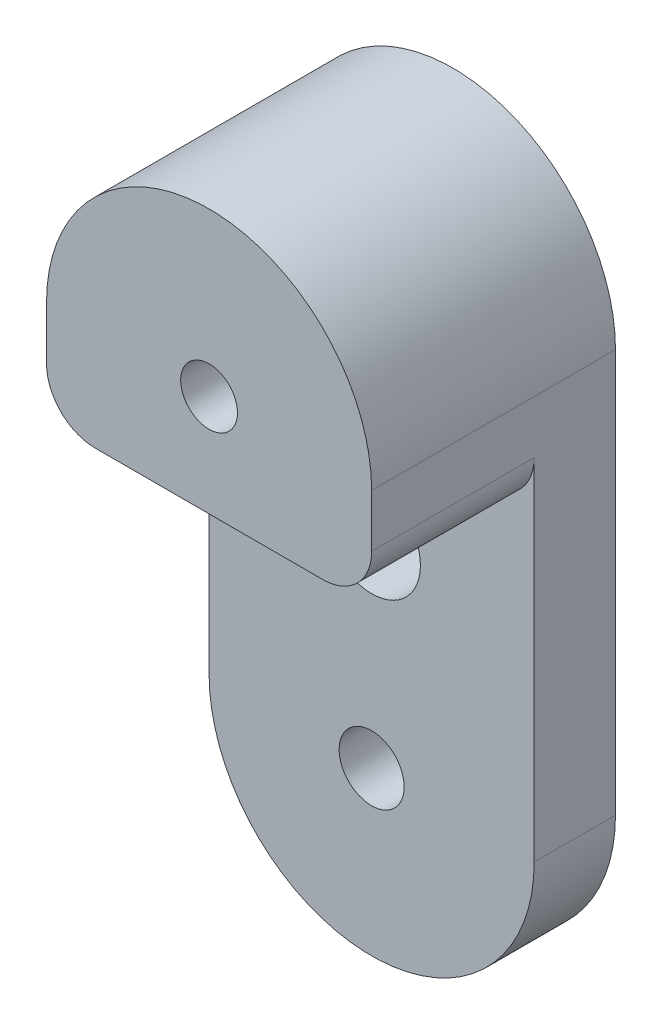
ISO-10303-21;
HEADER;
FILE_DESCRIPTION(('STEP AP214'),'2;1');
FILE_NAME('part.step','',(''),(''),'','','');
FILE_SCHEMA(('AUTOMOTIVE_DESIGN { 1 0 10303 214 1 1 1 1 }'));
ENDSEC;
DATA;
#1=APPLICATION_CONTEXT('core data for automotive mechanical design processes');
#2=APPLICATION_PROTOCOL_DEFINITION('international standard','automotive_design',2000,#1);
#3=PRODUCT_CONTEXT('',#1,'mechanical');
#4=PRODUCT('Part','Part','',(#3));
#5=PRODUCT_RELATED_PRODUCT_CATEGORY('part','',(#4));
#6=PRODUCT_DEFINITION_FORMATION('','',#4);
#7=PRODUCT_DEFINITION_CONTEXT('part definition',#1,'design');
#8=PRODUCT_DEFINITION('design','',#6,#7);
#9=PRODUCT_DEFINITION_SHAPE('','',#8);
#10=(LENGTH_UNIT() NAMED_UNIT(*) SI_UNIT(.MILLI.,.METRE.));
#11=(NAMED_UNIT(*) PLANE_ANGLE_UNIT() SI_UNIT($,.RADIAN.));
#12=(NAMED_UNIT(*) SI_UNIT($,.STERADIAN.) SOLID_ANGLE_UNIT());
#13=UNCERTAINTY_MEASURE_WITH_UNIT(LENGTH_MEASURE(1.E-05),#10,'distance_accuracy_value','');
#14=(GEOMETRIC_REPRESENTATION_CONTEXT(3) GLOBAL_UNCERTAINTY_ASSIGNED_CONTEXT((#13)) GLOBAL_UNIT_ASSIGNED_CONTEXT((#10,
#11,#12)) REPRESENTATION_CONTEXT('',''));
#15=CARTESIAN_POINT('',(0.,0.,0.));
#16=DIRECTION('',(0.,0.,1.));
#17=DIRECTION('',(1.,0.,0.));
#18=AXIS2_PLACEMENT_3D('',#15,#16,#17);
#19=CARTESIAN_POINT('',(-10.,0.,5.));
#20=DIRECTION('',(1.,0.,0.));
#21=DIRECTION('',(0.,1.,0.));
#22=AXIS2_PLACEMENT_3D('',#19,#20,#21);
#23=PLANE('',#22);
#24=DIRECTION('',(0.,-1.,0.));
#25=VECTOR('',#24,1.);
#26=CARTESIAN_POINT('',(-10.,0.,5.));
#27=LINE('',#26,#25);
#28=CARTESIAN_POINT('',(-10.,-3.25,5.));
#29=VERTEX_POINT('',#28);
#30=CARTESIAN_POINT('',(-10.,-24.8,5.));
#31=VERTEX_POINT('',#30);
#32=EDGE_CURVE('E50',#29,#31,#27,.T.);
#33=ORIENTED_EDGE('',*,*,#32,.F.);
#34=DIRECTION('',(0.,0.,-1.));
#35=VECTOR('',#34,1.);
#36=CARTESIAN_POINT('',(-10.,-3.25,5.));
#37=LINE('',#36,#35);
#38=CARTESIAN_POINT('',(-10.,-3.25,15.));
#39=VERTEX_POINT('',#38);
#40=EDGE_CURVE('E54',#29,#39,#37,.F.);
#41=ORIENTED_EDGE('',*,*,#40,.T.);
#42=DIRECTION('',(0.,-1.,0.));
#43=VECTOR('',#42,1.);
#44=CARTESIAN_POINT('',(-10.,0.,15.));
#45=LINE('',#44,#43);
#46=CARTESIAN_POINT('',(-10.,0.,15.));
#47=VERTEX_POINT('',#46);
#48=EDGE_CURVE('E129',#47,#39,#45,.T.);
#49=ORIENTED_EDGE('',*,*,#48,.F.);
#50=DIRECTION('',(0.,0.,-1.));
#51=VECTOR('',#50,1.);
#52=CARTESIAN_POINT('',(-10.,0.,15.));
#53=LINE('',#52,#51);
#54=CARTESIAN_POINT('',(-10.,0.,0.));
#55=VERTEX_POINT('',#54);
#56=EDGE_CURVE('E113',#47,#55,#53,.T.);
#57=ORIENTED_EDGE('',*,*,#56,.T.);
#58=DIRECTION('',(0.,-1.,0.));
#59=VECTOR('',#58,1.);
#60=CARTESIAN_POINT('',(-10.,0.,0.));
#61=LINE('',#60,#59);
#62=CARTESIAN_POINT('',(-10.,-24.8,0.));
#63=VERTEX_POINT('',#62);
#64=EDGE_CURVE('E162',#55,#63,#61,.T.);
#65=ORIENTED_EDGE('',*,*,#64,.T.);
#66=DIRECTION('',(0.,0.,-1.));
#67=VECTOR('',#66,1.);
#68=CARTESIAN_POINT('',(-10.,-24.8,5.));
#69=LINE('',#68,#67);
#70=EDGE_CURVE('E170',#31,#63,#69,.T.);
#71=ORIENTED_EDGE('',*,*,#70,.F.);
#72=EDGE_LOOP('',(#33,#41,#49,#57,#65,#71));
#73=FACE_BOUND('',#72,.T.);
#74=ADVANCED_FACE('F35',(#73),#23,.F.);
#75=CARTESIAN_POINT('',(0.,-24.8,5.));
#76=DIRECTION('',(0.,0.,-1.));
#77=DIRECTION('',(-1.,0.,0.));
#78=AXIS2_PLACEMENT_3D('',#75,#76,#77);
#79=CYLINDRICAL_SURFACE('',#78,10.);
#80=CARTESIAN_POINT('',(0.,-24.8,0.));
#81=DIRECTION('',(0.,0.,1.));
#82=DIRECTION('',(1.,0.,0.));
#83=AXIS2_PLACEMENT_3D('',#80,#81,#82);
#84=CIRCLE('',#83,10.);
#85=CARTESIAN_POINT('',(10.,-24.8,0.));
#86=VERTEX_POINT('',#85);
#87=EDGE_CURVE('E165',#63,#86,#84,.T.);
#88=ORIENTED_EDGE('',*,*,#87,.T.);
#89=DIRECTION('',(0.,0.,-1.));
#90=VECTOR('',#89,1.);
#91=CARTESIAN_POINT('',(10.,-24.8,5.));
#92=LINE('',#91,#90);
#93=CARTESIAN_POINT('',(10.,-24.8,5.));
#94=VERTEX_POINT('',#93);
#95=EDGE_CURVE('E156',#94,#86,#92,.T.);
#96=ORIENTED_EDGE('',*,*,#95,.F.);
#97=CARTESIAN_POINT('',(0.,-24.8,5.));
#98=DIRECTION('',(0.,0.,1.));
#99=DIRECTION('',(1.,0.,0.));
#100=AXIS2_PLACEMENT_3D('',#97,#98,#99);
#101=CIRCLE('',#100,10.);
#102=EDGE_CURVE('E148',#31,#94,#101,.T.);
#103=ORIENTED_EDGE('',*,*,#102,.F.);
#104=ORIENTED_EDGE('',*,*,#70,.T.);
#105=EDGE_LOOP('',(#88,#96,#103,#104));
#106=FACE_BOUND('',#105,.T.);
#107=ADVANCED_FACE('F196',(#106),#79,.T.);
#108=CARTESIAN_POINT('',(10.,0.,5.));
#109=DIRECTION('',(1.,0.,0.));
#110=DIRECTION('',(0.,1.,0.));
#111=AXIS2_PLACEMENT_3D('',#108,#109,#110);
#112=PLANE('',#111);
#113=DIRECTION('',(0.,-1.,0.));
#114=VECTOR('',#113,1.);
#115=CARTESIAN_POINT('',(10.,0.,15.));
#116=LINE('',#115,#114);
#117=CARTESIAN_POINT('',(10.,0.,15.));
#118=VERTEX_POINT('',#117);
#119=CARTESIAN_POINT('',(10.,-3.25,15.));
#120=VERTEX_POINT('',#119);
#121=EDGE_CURVE('E105',#118,#120,#116,.T.);
#122=ORIENTED_EDGE('',*,*,#121,.T.);
#123=DIRECTION('',(0.,0.,-1.));
#124=VECTOR('',#123,1.);
#125=CARTESIAN_POINT('',(10.,-3.25,5.));
#126=LINE('',#125,#124);
#127=CARTESIAN_POINT('',(10.,-3.25,5.));
#128=VERTEX_POINT('',#127);
#129=EDGE_CURVE('E173',#120,#128,#126,.T.);
#130=ORIENTED_EDGE('',*,*,#129,.T.);
#131=DIRECTION('',(0.,-1.,0.));
#132=VECTOR('',#131,1.);
#133=CARTESIAN_POINT('',(10.,0.,5.));
#134=LINE('',#133,#132);
#135=EDGE_CURVE('E150',#128,#94,#134,.T.);
#136=ORIENTED_EDGE('',*,*,#135,.T.);
#137=ORIENTED_EDGE('',*,*,#95,.T.);
#138=DIRECTION('',(0.,-1.,0.));
#139=VECTOR('',#138,1.);
#140=CARTESIAN_POINT('',(10.,0.,0.));
#141=LINE('',#140,#139);
#142=CARTESIAN_POINT('',(10.,0.,0.));
#143=VERTEX_POINT('',#142);
#144=EDGE_CURVE('E108',#143,#86,#141,.T.);
#145=ORIENTED_EDGE('',*,*,#144,.F.);
#146=DIRECTION('',(0.,0.,-1.));
#147=VECTOR('',#146,1.);
#148=CARTESIAN_POINT('',(10.,0.,15.));
#149=LINE('',#148,#147);
#150=EDGE_CURVE('E100',#118,#143,#149,.T.);
#151=ORIENTED_EDGE('',*,*,#150,.F.);
#152=EDGE_LOOP('',(#122,#130,#136,#137,#145,#151));
#153=FACE_BOUND('',#152,.T.);
#154=ADVANCED_FACE('F102',(#153),#112,.T.);
#155=CARTESIAN_POINT('',(0.,-24.8,5.));
#156=DIRECTION('',(0.,0.,-1.));
#157=DIRECTION('',(-1.,0.,0.));
#158=AXIS2_PLACEMENT_3D('',#155,#156,#157);
#159=CYLINDRICAL_SURFACE('',#158,2.);
#160=CARTESIAN_POINT('',(0.,-24.8,5.));
#161=DIRECTION('',(0.,0.,1.));
#162=DIRECTION('',(1.,0.,0.));
#163=AXIS2_PLACEMENT_3D('',#160,#161,#162);
#164=CIRCLE('',#163,2.);
#165=CARTESIAN_POINT('',(2.00000000000001,-24.8,5.));
#166=VERTEX_POINT('',#165);
#167=EDGE_CURVE('E144',#166,#166,#164,.T.);
#168=ORIENTED_EDGE('',*,*,#167,.T.);
#169=EDGE_LOOP('',(#168));
#170=FACE_BOUND('',#169,.T.);
#171=CARTESIAN_POINT('',(0.,-24.8,0.));
#172=DIRECTION('',(0.,0.,1.));
#173=DIRECTION('',(1.,0.,0.));
#174=AXIS2_PLACEMENT_3D('',#171,#172,#173);
#175=CIRCLE('',#174,2.);
#176=CARTESIAN_POINT('',(2.00000000000001,-24.8,0.));
#177=VERTEX_POINT('',#176);
#178=EDGE_CURVE('E159',#177,#177,#175,.T.);
#179=ORIENTED_EDGE('',*,*,#178,.F.);
#180=EDGE_LOOP('',(#179));
#181=FACE_BOUND('',#180,.T.);
#182=ADVANCED_FACE('F214',(#170,#181),#159,.F.);
#183=CARTESIAN_POINT('',(0.,-12.5,5.));
#184=DIRECTION('',(0.,0.,-1.));
#185=DIRECTION('',(-1.,0.,0.));
#186=AXIS2_PLACEMENT_3D('',#183,#184,#185);
#187=CYLINDRICAL_SURFACE('',#186,3.);
#188=CARTESIAN_POINT('',(0.,-12.5,5.));
#189=DIRECTION('',(0.,0.,1.));
#190=DIRECTION('',(1.,0.,0.));
#191=AXIS2_PLACEMENT_3D('',#188,#189,#190);
#192=CIRCLE('',#191,3.);
#193=CARTESIAN_POINT('',(3.,-12.5,5.));
#194=VERTEX_POINT('',#193);
#195=EDGE_CURVE('E141',#194,#194,#192,.T.);
#196=ORIENTED_EDGE('',*,*,#195,.T.);
#197=EDGE_LOOP('',(#196));
#198=FACE_BOUND('',#197,.T.);
#199=CARTESIAN_POINT('',(0.,-12.5,0.));
#200=DIRECTION('',(0.,0.,1.));
#201=DIRECTION('',(1.,0.,0.));
#202=AXIS2_PLACEMENT_3D('',#199,#200,#201);
#203=CIRCLE('',#202,3.);
#204=CARTESIAN_POINT('',(3.,-12.5,0.));
#205=VERTEX_POINT('',#204);
#206=EDGE_CURVE('E112',#205,#205,#203,.T.);
#207=ORIENTED_EDGE('',*,*,#206,.F.);
#208=EDGE_LOOP('',(#207));
#209=FACE_BOUND('',#208,.T.);
#210=ADVANCED_FACE('F217',(#198,#209),#187,.F.);
#211=CARTESIAN_POINT('',(0.,0.,5.));
#212=DIRECTION('',(0.,0.,1.));
#213=DIRECTION('',(1.,0.,0.));
#214=AXIS2_PLACEMENT_3D('',#211,#212,#213);
#215=PLANE('',#214);
#216=ORIENTED_EDGE('',*,*,#195,.F.);
#217=EDGE_LOOP('',(#216));
#218=FACE_BOUND('',#217,.T.);
#219=ORIENTED_EDGE('',*,*,#167,.F.);
#220=EDGE_LOOP('',(#219));
#221=FACE_BOUND('',#220,.T.);
#222=ORIENTED_EDGE('',*,*,#32,.T.);
#223=ORIENTED_EDGE('',*,*,#102,.T.);
#224=ORIENTED_EDGE('',*,*,#135,.F.);
#225=CARTESIAN_POINT('',(7.,-3.25,5.));
#226=DIRECTION('',(0.,0.,1.));
#227=DIRECTION('',(1.,0.,0.));
#228=AXIS2_PLACEMENT_3D('',#225,#226,#227);
#229=CIRCLE('',#228,3.);
#230=CARTESIAN_POINT('',(7.,-6.25,5.));
#231=VERTEX_POINT('',#230);
#232=EDGE_CURVE('E43',#128,#231,#229,.F.);
#233=ORIENTED_EDGE('',*,*,#232,.T.);
#234=DIRECTION('',(1.,0.,0.));
#235=VECTOR('',#234,1.);
#236=CARTESIAN_POINT('',(0.,-6.25,5.));
#237=LINE('',#236,#235);
#238=CARTESIAN_POINT('',(-7.,-6.25,5.));
#239=VERTEX_POINT('',#238);
#240=EDGE_CURVE('E153',#239,#231,#237,.T.);
#241=ORIENTED_EDGE('',*,*,#240,.F.);
#242=CARTESIAN_POINT('',(-7.,-3.25,5.));
#243=DIRECTION('',(0.,0.,1.));
#244=DIRECTION('',(1.,0.,0.));
#245=AXIS2_PLACEMENT_3D('',#242,#243,#244);
#246=CIRCLE('',#245,3.);
#247=EDGE_CURVE('E11',#239,#29,#246,.F.);
#248=ORIENTED_EDGE('',*,*,#247,.T.);
#249=EDGE_LOOP('',(#222,#223,#224,#233,#241,#248));
#250=FACE_BOUND('',#249,.T.);
#251=ADVANCED_FACE('F186',(#218,#221,#250),#215,.T.);
#252=CARTESIAN_POINT('',(0.,0.,0.));
#253=DIRECTION('',(0.,0.,1.));
#254=DIRECTION('',(1.,0.,0.));
#255=AXIS2_PLACEMENT_3D('',#252,#253,#254);
#256=PLANE('',#255);
#257=ORIENTED_EDGE('',*,*,#206,.T.);
#258=EDGE_LOOP('',(#257));
#259=FACE_BOUND('',#258,.T.);
#260=ORIENTED_EDGE('',*,*,#178,.T.);
#261=EDGE_LOOP('',(#260));
#262=FACE_BOUND('',#261,.T.);
#263=ORIENTED_EDGE('',*,*,#64,.F.);
#264=CARTESIAN_POINT('',(0.,0.,0.));
#265=DIRECTION('',(0.,0.,1.));
#266=DIRECTION('',(1.,0.,0.));
#267=AXIS2_PLACEMENT_3D('',#264,#265,#266);
#268=CIRCLE('',#267,10.);
#269=EDGE_CURVE('E135',#143,#55,#268,.T.);
#270=ORIENTED_EDGE('',*,*,#269,.F.);
#271=ORIENTED_EDGE('',*,*,#144,.T.);
#272=ORIENTED_EDGE('',*,*,#87,.F.);
#273=EDGE_LOOP('',(#263,#270,#271,#272));
#274=FACE_BOUND('',#273,.T.);
#275=CARTESIAN_POINT('',(0.,0.,0.));
#276=DIRECTION('',(0.,0.,1.));
#277=DIRECTION('',(1.,0.,0.));
#278=AXIS2_PLACEMENT_3D('',#275,#276,#277);
#279=CIRCLE('',#278,1.74625);
#280=CARTESIAN_POINT('',(1.74625,0.,0.));
#281=VERTEX_POINT('',#280);
#282=EDGE_CURVE('E137',#281,#281,#279,.T.);
#283=ORIENTED_EDGE('',*,*,#282,.T.);
#284=EDGE_LOOP('',(#283));
#285=FACE_BOUND('',#284,.T.);
#286=ADVANCED_FACE('F198',(#259,#262,#274,#285),#256,.F.);
#287=CARTESIAN_POINT('',(0.,-6.25,15.));
#288=DIRECTION('',(0.,1.,0.));
#289=DIRECTION('',(-1.,0.,0.));
#290=AXIS2_PLACEMENT_3D('',#287,#288,#289);
#291=PLANE('',#290);
#292=ORIENTED_EDGE('',*,*,#240,.T.);
#293=DIRECTION('',(0.,0.,-1.));
#294=VECTOR('',#293,1.);
#295=CARTESIAN_POINT('',(7.,-6.25,15.));
#296=LINE('',#295,#294);
#297=CARTESIAN_POINT('',(7.,-6.25,15.));
#298=VERTEX_POINT('',#297);
#299=EDGE_CURVE('E178',#231,#298,#296,.F.);
#300=ORIENTED_EDGE('',*,*,#299,.T.);
#301=DIRECTION('',(1.,0.,0.));
#302=VECTOR('',#301,1.);
#303=CARTESIAN_POINT('',(0.,-6.25,15.));
#304=LINE('',#303,#302);
#305=CARTESIAN_POINT('',(-7.,-6.25,15.));
#306=VERTEX_POINT('',#305);
#307=EDGE_CURVE('E127',#306,#298,#304,.T.);
#308=ORIENTED_EDGE('',*,*,#307,.F.);
#309=DIRECTION('',(0.,0.,-1.));
#310=VECTOR('',#309,1.);
#311=CARTESIAN_POINT('',(-7.,-6.25,15.));
#312=LINE('',#311,#310);
#313=EDGE_CURVE('E175',#306,#239,#312,.T.);
#314=ORIENTED_EDGE('',*,*,#313,.T.);
#315=EDGE_LOOP('',(#292,#300,#308,#314));
#316=FACE_BOUND('',#315,.T.);
#317=ADVANCED_FACE('F190',(#316),#291,.F.);
#318=CARTESIAN_POINT('',(0.,0.,15.));
#319=DIRECTION('',(0.,0.,-1.));
#320=DIRECTION('',(-1.,0.,0.));
#321=AXIS2_PLACEMENT_3D('',#318,#319,#320);
#322=CYLINDRICAL_SURFACE('',#321,10.);
#323=ORIENTED_EDGE('',*,*,#269,.T.);
#324=ORIENTED_EDGE('',*,*,#56,.F.);
#325=CARTESIAN_POINT('',(0.,0.,15.));
#326=DIRECTION('',(0.,0.,1.));
#327=DIRECTION('',(1.,0.,0.));
#328=AXIS2_PLACEMENT_3D('',#325,#326,#327);
#329=CIRCLE('',#328,10.);
#330=EDGE_CURVE('E116',#118,#47,#329,.T.);
#331=ORIENTED_EDGE('',*,*,#330,.F.);
#332=ORIENTED_EDGE('',*,*,#150,.T.);
#333=EDGE_LOOP('',(#323,#324,#331,#332));
#334=FACE_BOUND('',#333,.T.);
#335=ADVANCED_FACE('F117',(#334),#322,.T.);
#336=CARTESIAN_POINT('',(0.,0.,15.));
#337=DIRECTION('',(0.,0.,-1.));
#338=DIRECTION('',(-1.,0.,0.));
#339=AXIS2_PLACEMENT_3D('',#336,#337,#338);
#340=CYLINDRICAL_SURFACE('',#339,1.74625);
#341=CARTESIAN_POINT('',(0.,0.,15.));
#342=DIRECTION('',(0.,0.,1.));
#343=DIRECTION('',(1.,0.,0.));
#344=AXIS2_PLACEMENT_3D('',#341,#342,#343);
#345=CIRCLE('',#344,1.74625);
#346=CARTESIAN_POINT('',(1.74625,0.,15.));
#347=VERTEX_POINT('',#346);
#348=EDGE_CURVE('E120',#347,#347,#345,.T.);
#349=ORIENTED_EDGE('',*,*,#348,.T.);
#350=EDGE_LOOP('',(#349));
#351=FACE_BOUND('',#350,.T.);
#352=ORIENTED_EDGE('',*,*,#282,.F.);
#353=EDGE_LOOP('',(#352));
#354=FACE_BOUND('',#353,.T.);
#355=ADVANCED_FACE('F272',(#351,#354),#340,.F.);
#356=CARTESIAN_POINT('',(0.,0.,15.));
#357=DIRECTION('',(0.,0.,1.));
#358=DIRECTION('',(1.,0.,0.));
#359=AXIS2_PLACEMENT_3D('',#356,#357,#358);
#360=PLANE('',#359);
#361=ORIENTED_EDGE('',*,*,#307,.T.);
#362=CARTESIAN_POINT('',(7.,-3.25,15.));
#363=DIRECTION('',(0.,0.,1.));
#364=DIRECTION('',(1.,0.,0.));
#365=AXIS2_PLACEMENT_3D('',#362,#363,#364);
#366=CIRCLE('',#365,3.);
#367=EDGE_CURVE('E126',#298,#120,#366,.T.);
#368=ORIENTED_EDGE('',*,*,#367,.T.);
#369=ORIENTED_EDGE('',*,*,#121,.F.);
#370=ORIENTED_EDGE('',*,*,#330,.T.);
#371=ORIENTED_EDGE('',*,*,#48,.T.);
#372=CARTESIAN_POINT('',(-7.,-3.25,15.));
#373=DIRECTION('',(0.,0.,1.));
#374=DIRECTION('',(1.,0.,0.));
#375=AXIS2_PLACEMENT_3D('',#372,#373,#374);
#376=CIRCLE('',#375,3.);
#377=EDGE_CURVE('E180',#39,#306,#376,.T.);
#378=ORIENTED_EDGE('',*,*,#377,.T.);
#379=EDGE_LOOP('',(#361,#368,#369,#370,#371,#378));
#380=FACE_BOUND('',#379,.T.);
#381=ORIENTED_EDGE('',*,*,#348,.F.);
#382=EDGE_LOOP('',(#381));
#383=FACE_BOUND('',#382,.T.);
#384=ADVANCED_FACE('F123',(#380,#383),#360,.T.);
#385=CARTESIAN_POINT('',(7.,-3.25,5.));
#386=DIRECTION('',(0.,0.,1.));
#387=DIRECTION('',(1.,0.,0.));
#388=AXIS2_PLACEMENT_3D('',#385,#386,#387);
#389=CYLINDRICAL_SURFACE('',#388,3.);
#390=ORIENTED_EDGE('',*,*,#367,.F.);
#391=ORIENTED_EDGE('',*,*,#299,.F.);
#392=ORIENTED_EDGE('',*,*,#232,.F.);
#393=ORIENTED_EDGE('',*,*,#129,.F.);
#394=EDGE_LOOP('',(#390,#391,#392,#393));
#395=FACE_BOUND('',#394,.T.);
#396=ADVANCED_FACE('F193',(#395),#389,.T.);
#397=CARTESIAN_POINT('',(-7.,-3.25,15.));
#398=DIRECTION('',(0.,0.,-1.));
#399=DIRECTION('',(-1.,0.,0.));
#400=AXIS2_PLACEMENT_3D('',#397,#398,#399);
#401=CYLINDRICAL_SURFACE('',#400,3.);
#402=ORIENTED_EDGE('',*,*,#377,.F.);
#403=ORIENTED_EDGE('',*,*,#40,.F.);
#404=ORIENTED_EDGE('',*,*,#247,.F.);
#405=ORIENTED_EDGE('',*,*,#313,.F.);
#406=EDGE_LOOP('',(#402,#403,#404,#405));
#407=FACE_BOUND('',#406,.T.);
#408=ADVANCED_FACE('F37',(#407),#401,.T.);
#409=CLOSED_SHELL('',(#74,#107,#154,#182,#210,#251,#286,#317,#335,#355,#384,#396,#408));
#410=MANIFOLD_SOLID_BREP('B2',#409);
#411=ADVANCED_BREP_SHAPE_REPRESENTATION('',(#18,#410),#14);
#412=SHAPE_DEFINITION_REPRESENTATION(#9,#411);
ENDSEC;
END-ISO-10303-21;
